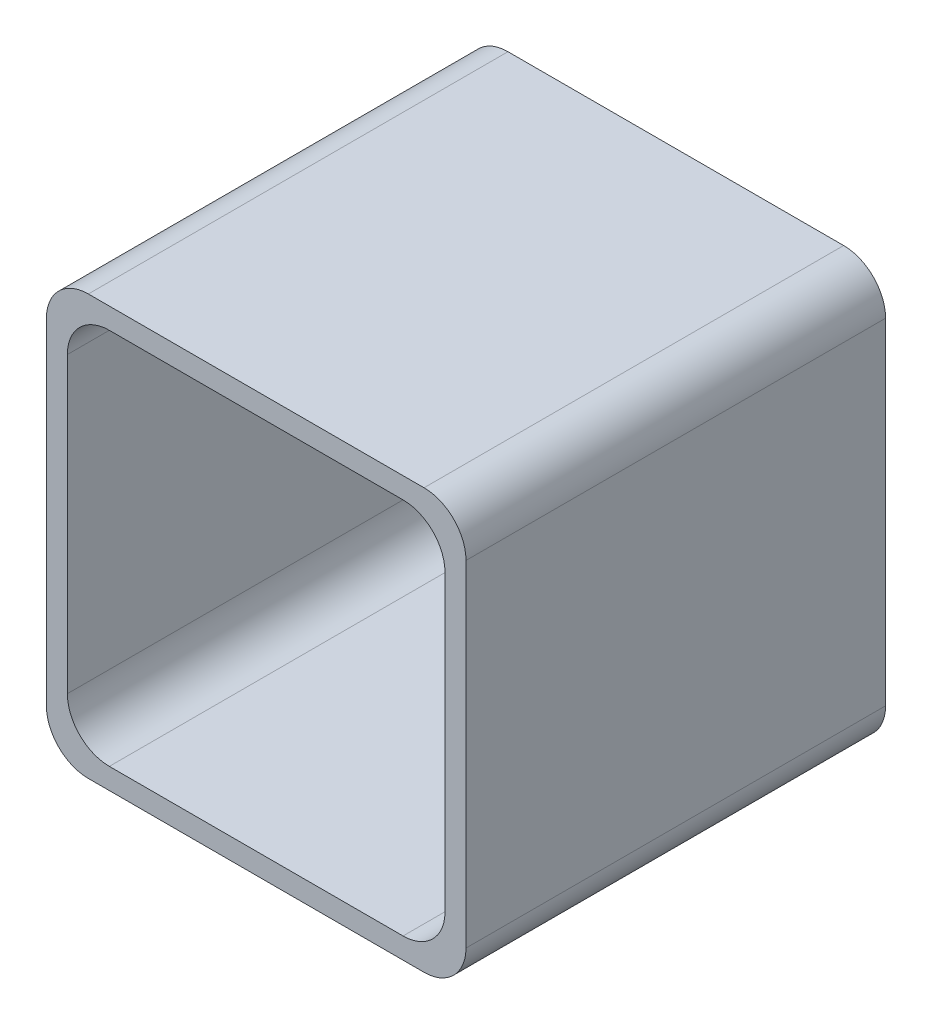
ISO-10303-21;
HEADER;
FILE_DESCRIPTION(('STEP AP214'),'2;1');
FILE_NAME('part.step','',(''),(''),'','','');
FILE_SCHEMA(('AUTOMOTIVE_DESIGN { 1 0 10303 214 1 1 1 1 }'));
ENDSEC;
DATA;
#1=APPLICATION_CONTEXT('core data for automotive mechanical design processes');
#2=APPLICATION_PROTOCOL_DEFINITION('international standard','automotive_design',2000,#1);
#3=PRODUCT_CONTEXT('',#1,'mechanical');
#4=PRODUCT('Part','Part','',(#3));
#5=PRODUCT_RELATED_PRODUCT_CATEGORY('part','',(#4));
#6=PRODUCT_DEFINITION_FORMATION('','',#4);
#7=PRODUCT_DEFINITION_CONTEXT('part definition',#1,'design');
#8=PRODUCT_DEFINITION('design','',#6,#7);
#9=PRODUCT_DEFINITION_SHAPE('','',#8);
#10=(LENGTH_UNIT() NAMED_UNIT(*) SI_UNIT(.MILLI.,.METRE.));
#11=(NAMED_UNIT(*) PLANE_ANGLE_UNIT() SI_UNIT($,.RADIAN.));
#12=(NAMED_UNIT(*) SI_UNIT($,.STERADIAN.) SOLID_ANGLE_UNIT());
#13=UNCERTAINTY_MEASURE_WITH_UNIT(LENGTH_MEASURE(1.E-05),#10,'distance_accuracy_value','');
#14=(GEOMETRIC_REPRESENTATION_CONTEXT(3) GLOBAL_UNCERTAINTY_ASSIGNED_CONTEXT((#13)) GLOBAL_UNIT_ASSIGNED_CONTEXT((#10,
#11,#12)) REPRESENTATION_CONTEXT('',''));
#15=CARTESIAN_POINT('',(0.,0.,0.));
#16=DIRECTION('',(0.,0.,1.));
#17=DIRECTION('',(1.,0.,0.));
#18=AXIS2_PLACEMENT_3D('',#15,#16,#17);
#19=CARTESIAN_POINT('',(25.,-25.,-50.));
#20=DIRECTION('',(1.,0.,0.));
#21=DIRECTION('',(0.,0.,-1.));
#22=AXIS2_PLACEMENT_3D('',#19,#20,#21);
#23=PLANE('',#22);
#24=DIRECTION('',(0.,1.,0.));
#25=VECTOR('',#24,1.);
#26=CARTESIAN_POINT('',(25.,-25.,-50.));
#27=LINE('',#26,#25);
#28=CARTESIAN_POINT('',(25.,-20.,-50.));
#29=VERTEX_POINT('',#28);
#30=CARTESIAN_POINT('',(25.,20.,-50.));
#31=VERTEX_POINT('',#30);
#32=EDGE_CURVE('E225',#29,#31,#27,.T.);
#33=ORIENTED_EDGE('',*,*,#32,.T.);
#34=DIRECTION('',(0.,0.,1.));
#35=VECTOR('',#34,1.);
#36=CARTESIAN_POINT('',(25.,20.,-50.));
#37=LINE('',#36,#35);
#38=CARTESIAN_POINT('',(25.,20.,0.));
#39=VERTEX_POINT('',#38);
#40=EDGE_CURVE('E306',#31,#39,#37,.T.);
#41=ORIENTED_EDGE('',*,*,#40,.T.);
#42=DIRECTION('',(0.,1.,0.));
#43=VECTOR('',#42,1.);
#44=CARTESIAN_POINT('',(25.,-25.,0.));
#45=LINE('',#44,#43);
#46=CARTESIAN_POINT('',(25.,-20.,0.));
#47=VERTEX_POINT('',#46);
#48=EDGE_CURVE('E210',#47,#39,#45,.T.);
#49=ORIENTED_EDGE('',*,*,#48,.F.);
#50=DIRECTION('',(0.,0.,1.));
#51=VECTOR('',#50,1.);
#52=CARTESIAN_POINT('',(25.,-20.,-50.));
#53=LINE('',#52,#51);
#54=EDGE_CURVE('E303',#47,#29,#53,.F.);
#55=ORIENTED_EDGE('',*,*,#54,.T.);
#56=EDGE_LOOP('',(#33,#41,#49,#55));
#57=FACE_BOUND('',#56,.T.);
#58=ADVANCED_FACE('F38',(#57),#23,.T.);
#59=CARTESIAN_POINT('',(-25.,-25.,-50.));
#60=DIRECTION('',(0.,-1.,0.));
#61=DIRECTION('',(0.,0.,-1.));
#62=AXIS2_PLACEMENT_3D('',#59,#60,#61);
#63=PLANE('',#62);
#64=CARTESIAN_POINT('',(0.,-25.,-38.1846380561692));
#65=DIRECTION('',(0.,-1.,0.));
#66=DIRECTION('',(0.,0.,-1.));
#67=AXIS2_PLACEMENT_3D('',#64,#65,#66);
#68=CIRCLE('',#67,6.);
#69=CARTESIAN_POINT('',(0.,-25.,-44.1846380561692));
#70=VERTEX_POINT('',#69);
#71=EDGE_CURVE('E177',#70,#70,#68,.T.);
#72=ORIENTED_EDGE('',*,*,#71,.F.);
#73=EDGE_LOOP('',(#72));
#74=FACE_BOUND('',#73,.T.);
#75=DIRECTION('',(1.,0.,0.));
#76=VECTOR('',#75,1.);
#77=CARTESIAN_POINT('',(-25.,-25.,-50.));
#78=LINE('',#77,#76);
#79=CARTESIAN_POINT('',(-20.,-25.,-50.));
#80=VERTEX_POINT('',#79);
#81=CARTESIAN_POINT('',(20.,-25.,-50.));
#82=VERTEX_POINT('',#81);
#83=EDGE_CURVE('E237',#80,#82,#78,.T.);
#84=ORIENTED_EDGE('',*,*,#83,.T.);
#85=DIRECTION('',(0.,0.,1.));
#86=VECTOR('',#85,1.);
#87=CARTESIAN_POINT('',(20.,-25.,-50.));
#88=LINE('',#87,#86);
#89=CARTESIAN_POINT('',(20.,-25.,0.));
#90=VERTEX_POINT('',#89);
#91=EDGE_CURVE('E343',#82,#90,#88,.T.);
#92=ORIENTED_EDGE('',*,*,#91,.T.);
#93=DIRECTION('',(1.,0.,0.));
#94=VECTOR('',#93,1.);
#95=CARTESIAN_POINT('',(-25.,-25.,0.));
#96=LINE('',#95,#94);
#97=CARTESIAN_POINT('',(-20.,-25.,0.));
#98=VERTEX_POINT('',#97);
#99=EDGE_CURVE('E230',#98,#90,#96,.T.);
#100=ORIENTED_EDGE('',*,*,#99,.F.);
#101=DIRECTION('',(0.,0.,1.));
#102=VECTOR('',#101,1.);
#103=CARTESIAN_POINT('',(-20.,-25.,-50.));
#104=LINE('',#103,#102);
#105=EDGE_CURVE('E340',#98,#80,#104,.F.);
#106=ORIENTED_EDGE('',*,*,#105,.T.);
#107=EDGE_LOOP('',(#84,#92,#100,#106));
#108=FACE_BOUND('',#107,.T.);
#109=ADVANCED_FACE('F412',(#74,#108),#63,.T.);
#110=CARTESIAN_POINT('',(-25.,-25.,-50.));
#111=DIRECTION('',(-1.,0.,0.));
#112=DIRECTION('',(0.,0.,1.));
#113=AXIS2_PLACEMENT_3D('',#110,#111,#112);
#114=PLANE('',#113);
#115=DIRECTION('',(0.,-1.,0.));
#116=VECTOR('',#115,1.);
#117=CARTESIAN_POINT('',(-25.,-25.,-50.));
#118=LINE('',#117,#116);
#119=CARTESIAN_POINT('',(-25.,20.,-50.));
#120=VERTEX_POINT('',#119);
#121=CARTESIAN_POINT('',(-25.,-20.,-50.));
#122=VERTEX_POINT('',#121);
#123=EDGE_CURVE('E234',#120,#122,#118,.T.);
#124=ORIENTED_EDGE('',*,*,#123,.T.);
#125=DIRECTION('',(0.,0.,1.));
#126=VECTOR('',#125,1.);
#127=CARTESIAN_POINT('',(-25.,-20.,-50.));
#128=LINE('',#127,#126);
#129=CARTESIAN_POINT('',(-25.,-20.,0.));
#130=VERTEX_POINT('',#129);
#131=EDGE_CURVE('E349',#122,#130,#128,.T.);
#132=ORIENTED_EDGE('',*,*,#131,.T.);
#133=DIRECTION('',(0.,-1.,0.));
#134=VECTOR('',#133,1.);
#135=CARTESIAN_POINT('',(-25.,-25.,0.));
#136=LINE('',#135,#134);
#137=CARTESIAN_POINT('',(-25.,20.,0.));
#138=VERTEX_POINT('',#137);
#139=EDGE_CURVE('E249',#138,#130,#136,.T.);
#140=ORIENTED_EDGE('',*,*,#139,.F.);
#141=DIRECTION('',(0.,0.,1.));
#142=VECTOR('',#141,1.);
#143=CARTESIAN_POINT('',(-25.,20.,-50.));
#144=LINE('',#143,#142);
#145=EDGE_CURVE('E61',#138,#120,#144,.F.);
#146=ORIENTED_EDGE('',*,*,#145,.T.);
#147=EDGE_LOOP('',(#124,#132,#140,#146));
#148=FACE_BOUND('',#147,.T.);
#149=ADVANCED_FACE('F417',(#148),#114,.T.);
#150=CARTESIAN_POINT('',(-25.,25.,-50.));
#151=DIRECTION('',(0.,1.,0.));
#152=DIRECTION('',(0.,0.,1.));
#153=AXIS2_PLACEMENT_3D('',#150,#151,#152);
#154=PLANE('',#153);
#155=DIRECTION('',(-1.,0.,0.));
#156=VECTOR('',#155,1.);
#157=CARTESIAN_POINT('',(-25.,25.,0.));
#158=LINE('',#157,#156);
#159=CARTESIAN_POINT('',(20.,25.,0.));
#160=VERTEX_POINT('',#159);
#161=CARTESIAN_POINT('',(-20.,25.,0.));
#162=VERTEX_POINT('',#161);
#163=EDGE_CURVE('E245',#160,#162,#158,.T.);
#164=ORIENTED_EDGE('',*,*,#163,.F.);
#165=DIRECTION('',(0.,0.,1.));
#166=VECTOR('',#165,1.);
#167=CARTESIAN_POINT('',(20.,25.,-50.));
#168=LINE('',#167,#166);
#169=CARTESIAN_POINT('',(20.,25.,-50.));
#170=VERTEX_POINT('',#169);
#171=EDGE_CURVE('E326',#160,#170,#168,.F.);
#172=ORIENTED_EDGE('',*,*,#171,.T.);
#173=DIRECTION('',(-1.,0.,0.));
#174=VECTOR('',#173,1.);
#175=CARTESIAN_POINT('',(-25.,25.,-50.));
#176=LINE('',#175,#174);
#177=CARTESIAN_POINT('',(-20.,25.,-50.));
#178=VERTEX_POINT('',#177);
#179=EDGE_CURVE('E229',#170,#178,#176,.T.);
#180=ORIENTED_EDGE('',*,*,#179,.T.);
#181=DIRECTION('',(0.,0.,1.));
#182=VECTOR('',#181,1.);
#183=CARTESIAN_POINT('',(-20.,25.,-50.));
#184=LINE('',#183,#182);
#185=EDGE_CURVE('E322',#178,#162,#184,.T.);
#186=ORIENTED_EDGE('',*,*,#185,.T.);
#187=EDGE_LOOP('',(#164,#172,#180,#186));
#188=FACE_BOUND('',#187,.T.);
#189=ADVANCED_FACE('F421',(#188),#154,.T.);
#190=CARTESIAN_POINT('',(0.,0.,-50.));
#191=DIRECTION('',(0.,0.,-1.));
#192=DIRECTION('',(-1.,0.,0.));
#193=AXIS2_PLACEMENT_3D('',#190,#191,#192);
#194=PLANE('',#193);
#195=ORIENTED_EDGE('',*,*,#179,.F.);
#196=CARTESIAN_POINT('',(20.,20.,-50.));
#197=DIRECTION('',(0.,0.,-1.));
#198=DIRECTION('',(-1.,0.,0.));
#199=AXIS2_PLACEMENT_3D('',#196,#197,#198);
#200=CIRCLE('',#199,5.);
#201=EDGE_CURVE('E337',#170,#31,#200,.T.);
#202=ORIENTED_EDGE('',*,*,#201,.T.);
#203=ORIENTED_EDGE('',*,*,#32,.F.);
#204=CARTESIAN_POINT('',(20.,-20.,-50.));
#205=DIRECTION('',(0.,0.,-1.));
#206=DIRECTION('',(-1.,0.,0.));
#207=AXIS2_PLACEMENT_3D('',#204,#205,#206);
#208=CIRCLE('',#207,5.);
#209=EDGE_CURVE('E334',#29,#82,#208,.T.);
#210=ORIENTED_EDGE('',*,*,#209,.T.);
#211=ORIENTED_EDGE('',*,*,#83,.F.);
#212=CARTESIAN_POINT('',(-20.,-20.,-50.));
#213=DIRECTION('',(0.,0.,-1.));
#214=DIRECTION('',(-1.,0.,0.));
#215=AXIS2_PLACEMENT_3D('',#212,#213,#214);
#216=CIRCLE('',#215,5.);
#217=EDGE_CURVE('E54',#80,#122,#216,.T.);
#218=ORIENTED_EDGE('',*,*,#217,.T.);
#219=ORIENTED_EDGE('',*,*,#123,.F.);
#220=CARTESIAN_POINT('',(-20.,20.,-50.));
#221=DIRECTION('',(0.,0.,-1.));
#222=DIRECTION('',(-1.,0.,0.));
#223=AXIS2_PLACEMENT_3D('',#220,#221,#222);
#224=CIRCLE('',#223,5.);
#225=EDGE_CURVE('E329',#120,#178,#224,.T.);
#226=ORIENTED_EDGE('',*,*,#225,.T.);
#227=EDGE_LOOP('',(#195,#202,#203,#210,#211,#218,#219,#226));
#228=FACE_BOUND('',#227,.T.);
#229=ADVANCED_FACE('F424',(#228),#194,.T.);
#230=CARTESIAN_POINT('',(0.,0.,0.));
#231=DIRECTION('',(0.,0.,-1.));
#232=DIRECTION('',(-1.,0.,0.));
#233=AXIS2_PLACEMENT_3D('',#230,#231,#232);
#234=PLANE('',#233);
#235=DIRECTION('',(-1.,0.,0.));
#236=VECTOR('',#235,1.);
#237=CARTESIAN_POINT('',(-22.5,22.5,0.));
#238=LINE('',#237,#236);
#239=CARTESIAN_POINT('',(17.5,22.5,0.));
#240=VERTEX_POINT('',#239);
#241=CARTESIAN_POINT('',(-17.5,22.5,0.));
#242=VERTEX_POINT('',#241);
#243=EDGE_CURVE('E214',#240,#242,#238,.T.);
#244=ORIENTED_EDGE('',*,*,#243,.F.);
#245=CARTESIAN_POINT('',(17.5,17.5,0.));
#246=DIRECTION('',(0.,0.,-1.));
#247=DIRECTION('',(-1.,0.,0.));
#248=AXIS2_PLACEMENT_3D('',#245,#246,#247);
#249=CIRCLE('',#248,5.);
#250=CARTESIAN_POINT('',(22.5,17.5,0.));
#251=VERTEX_POINT('',#250);
#252=EDGE_CURVE('E353',#240,#251,#249,.T.);
#253=ORIENTED_EDGE('',*,*,#252,.T.);
#254=DIRECTION('',(0.,1.,0.));
#255=VECTOR('',#254,1.);
#256=CARTESIAN_POINT('',(22.5,-22.5,0.));
#257=LINE('',#256,#255);
#258=CARTESIAN_POINT('',(22.5,-17.5,0.));
#259=VERTEX_POINT('',#258);
#260=EDGE_CURVE('E192',#259,#251,#257,.T.);
#261=ORIENTED_EDGE('',*,*,#260,.F.);
#262=CARTESIAN_POINT('',(17.5,-17.5,0.));
#263=DIRECTION('',(0.,0.,-1.));
#264=DIRECTION('',(-1.,0.,0.));
#265=AXIS2_PLACEMENT_3D('',#262,#263,#264);
#266=CIRCLE('',#265,5.);
#267=CARTESIAN_POINT('',(17.5,-22.5,0.));
#268=VERTEX_POINT('',#267);
#269=EDGE_CURVE('E356',#259,#268,#266,.T.);
#270=ORIENTED_EDGE('',*,*,#269,.T.);
#271=DIRECTION('',(1.,0.,0.));
#272=VECTOR('',#271,1.);
#273=CARTESIAN_POINT('',(-22.5,-22.5,0.));
#274=LINE('',#273,#272);
#275=CARTESIAN_POINT('',(-17.5,-22.5,0.));
#276=VERTEX_POINT('',#275);
#277=EDGE_CURVE('E198',#276,#268,#274,.T.);
#278=ORIENTED_EDGE('',*,*,#277,.F.);
#279=CARTESIAN_POINT('',(-17.5,-17.5,0.));
#280=DIRECTION('',(0.,0.,-1.));
#281=DIRECTION('',(-1.,0.,0.));
#282=AXIS2_PLACEMENT_3D('',#279,#280,#281);
#283=CIRCLE('',#282,5.);
#284=CARTESIAN_POINT('',(-22.5,-17.5,0.));
#285=VERTEX_POINT('',#284);
#286=EDGE_CURVE('E11',#276,#285,#283,.T.);
#287=ORIENTED_EDGE('',*,*,#286,.T.);
#288=DIRECTION('',(0.,-1.,0.));
#289=VECTOR('',#288,1.);
#290=CARTESIAN_POINT('',(-22.5,-22.5,0.));
#291=LINE('',#290,#289);
#292=CARTESIAN_POINT('',(-22.5,17.5,0.));
#293=VERTEX_POINT('',#292);
#294=EDGE_CURVE('E218',#293,#285,#291,.T.);
#295=ORIENTED_EDGE('',*,*,#294,.F.);
#296=CARTESIAN_POINT('',(-17.5,17.5,0.));
#297=DIRECTION('',(0.,0.,-1.));
#298=DIRECTION('',(-1.,0.,0.));
#299=AXIS2_PLACEMENT_3D('',#296,#297,#298);
#300=CIRCLE('',#299,5.);
#301=EDGE_CURVE('E47',#293,#242,#300,.T.);
#302=ORIENTED_EDGE('',*,*,#301,.T.);
#303=EDGE_LOOP('',(#244,#253,#261,#270,#278,#287,#295,#302));
#304=FACE_BOUND('',#303,.T.);
#305=ORIENTED_EDGE('',*,*,#48,.T.);
#306=CARTESIAN_POINT('',(20.,20.,0.));
#307=DIRECTION('',(0.,0.,-1.));
#308=DIRECTION('',(-1.,0.,0.));
#309=AXIS2_PLACEMENT_3D('',#306,#307,#308);
#310=CIRCLE('',#309,5.);
#311=EDGE_CURVE('E319',#39,#160,#310,.F.);
#312=ORIENTED_EDGE('',*,*,#311,.T.);
#313=ORIENTED_EDGE('',*,*,#163,.T.);
#314=CARTESIAN_POINT('',(-20.,20.,0.));
#315=DIRECTION('',(0.,0.,-1.));
#316=DIRECTION('',(-1.,0.,0.));
#317=AXIS2_PLACEMENT_3D('',#314,#315,#316);
#318=CIRCLE('',#317,5.);
#319=EDGE_CURVE('E310',#162,#138,#318,.F.);
#320=ORIENTED_EDGE('',*,*,#319,.T.);
#321=ORIENTED_EDGE('',*,*,#139,.T.);
#322=CARTESIAN_POINT('',(-20.,-20.,0.));
#323=DIRECTION('',(0.,0.,-1.));
#324=DIRECTION('',(-1.,0.,0.));
#325=AXIS2_PLACEMENT_3D('',#322,#323,#324);
#326=CIRCLE('',#325,5.);
#327=EDGE_CURVE('E313',#130,#98,#326,.F.);
#328=ORIENTED_EDGE('',*,*,#327,.T.);
#329=ORIENTED_EDGE('',*,*,#99,.T.);
#330=CARTESIAN_POINT('',(20.,-20.,0.));
#331=DIRECTION('',(0.,0.,-1.));
#332=DIRECTION('',(-1.,0.,0.));
#333=AXIS2_PLACEMENT_3D('',#330,#331,#332);
#334=CIRCLE('',#333,5.);
#335=EDGE_CURVE('E316',#90,#47,#334,.F.);
#336=ORIENTED_EDGE('',*,*,#335,.T.);
#337=EDGE_LOOP('',(#305,#312,#313,#320,#321,#328,#329,#336));
#338=FACE_BOUND('',#337,.T.);
#339=ADVANCED_FACE('F362',(#304,#338),#234,.F.);
#340=CARTESIAN_POINT('',(22.5,-22.5,-45.));
#341=DIRECTION('',(1.,0.,0.));
#342=DIRECTION('',(0.,0.,-1.));
#343=AXIS2_PLACEMENT_3D('',#340,#341,#342);
#344=PLANE('',#343);
#345=ORIENTED_EDGE('',*,*,#260,.T.);
#346=DIRECTION('',(0.,0.,1.));
#347=VECTOR('',#346,1.);
#348=CARTESIAN_POINT('',(22.5,17.5,-45.));
#349=LINE('',#348,#347);
#350=CARTESIAN_POINT('',(22.5,17.5,-45.));
#351=VERTEX_POINT('',#350);
#352=EDGE_CURVE('E274',#251,#351,#349,.F.);
#353=ORIENTED_EDGE('',*,*,#352,.T.);
#354=DIRECTION('',(0.,1.,0.));
#355=VECTOR('',#354,1.);
#356=CARTESIAN_POINT('',(22.5,-22.5,-45.));
#357=LINE('',#356,#355);
#358=CARTESIAN_POINT('',(22.5,-17.5,-45.));
#359=VERTEX_POINT('',#358);
#360=EDGE_CURVE('E193',#359,#351,#357,.T.);
#361=ORIENTED_EDGE('',*,*,#360,.F.);
#362=DIRECTION('',(0.,0.,1.));
#363=VECTOR('',#362,1.);
#364=CARTESIAN_POINT('',(22.5,-17.5,0.));
#365=LINE('',#364,#363);
#366=EDGE_CURVE('E270',#359,#259,#365,.T.);
#367=ORIENTED_EDGE('',*,*,#366,.T.);
#368=EDGE_LOOP('',(#345,#353,#361,#367));
#369=FACE_BOUND('',#368,.T.);
#370=ADVANCED_FACE('F395',(#369),#344,.F.);
#371=CARTESIAN_POINT('',(-22.5,-22.5,-45.));
#372=DIRECTION('',(0.,-1.,0.));
#373=DIRECTION('',(0.,0.,-1.));
#374=AXIS2_PLACEMENT_3D('',#371,#372,#373);
#375=PLANE('',#374);
#376=CARTESIAN_POINT('',(0.,-22.5,-38.1846380561692));
#377=DIRECTION('',(0.,1.,0.));
#378=DIRECTION('',(0.,0.,1.));
#379=AXIS2_PLACEMENT_3D('',#376,#377,#378);
#380=CIRCLE('',#379,6.);
#381=CARTESIAN_POINT('',(0.,-22.5,-32.1846380561692));
#382=VERTEX_POINT('',#381);
#383=EDGE_CURVE('E682',#382,#382,#380,.T.);
#384=ORIENTED_EDGE('',*,*,#383,.F.);
#385=EDGE_LOOP('',(#384));
#386=FACE_BOUND('',#385,.T.);
#387=ORIENTED_EDGE('',*,*,#277,.T.);
#388=DIRECTION('',(0.,0.,1.));
#389=VECTOR('',#388,1.);
#390=CARTESIAN_POINT('',(17.5,-22.5,-45.));
#391=LINE('',#390,#389);
#392=CARTESIAN_POINT('',(17.5,-22.5,-45.));
#393=VERTEX_POINT('',#392);
#394=EDGE_CURVE('E293',#268,#393,#391,.F.);
#395=ORIENTED_EDGE('',*,*,#394,.T.);
#396=DIRECTION('',(1.,0.,0.));
#397=VECTOR('',#396,1.);
#398=CARTESIAN_POINT('',(-22.5,-22.5,-45.));
#399=LINE('',#398,#397);
#400=CARTESIAN_POINT('',(-17.5,-22.5,-45.));
#401=VERTEX_POINT('',#400);
#402=EDGE_CURVE('E206',#401,#393,#399,.T.);
#403=ORIENTED_EDGE('',*,*,#402,.F.);
#404=DIRECTION('',(0.,0.,1.));
#405=VECTOR('',#404,1.);
#406=CARTESIAN_POINT('',(-17.5,-22.5,0.));
#407=LINE('',#406,#405);
#408=EDGE_CURVE('E289',#401,#276,#407,.T.);
#409=ORIENTED_EDGE('',*,*,#408,.T.);
#410=EDGE_LOOP('',(#387,#395,#403,#409));
#411=FACE_BOUND('',#410,.T.);
#412=ADVANCED_FACE('F386',(#386,#411),#375,.F.);
#413=CARTESIAN_POINT('',(-22.5,-22.5,-45.));
#414=DIRECTION('',(-1.,0.,0.));
#415=DIRECTION('',(0.,0.,1.));
#416=AXIS2_PLACEMENT_3D('',#413,#414,#415);
#417=PLANE('',#416);
#418=DIRECTION('',(0.,-1.,0.));
#419=VECTOR('',#418,1.);
#420=CARTESIAN_POINT('',(-22.5,-22.5,-45.));
#421=LINE('',#420,#419);
#422=CARTESIAN_POINT('',(-22.5,17.5,-45.));
#423=VERTEX_POINT('',#422);
#424=CARTESIAN_POINT('',(-22.5,-17.5,-45.));
#425=VERTEX_POINT('',#424);
#426=EDGE_CURVE('E202',#423,#425,#421,.T.);
#427=ORIENTED_EDGE('',*,*,#426,.F.);
#428=DIRECTION('',(0.,0.,1.));
#429=VECTOR('',#428,1.);
#430=CARTESIAN_POINT('',(-22.5,17.5,0.));
#431=LINE('',#430,#429);
#432=EDGE_CURVE('E299',#423,#293,#431,.T.);
#433=ORIENTED_EDGE('',*,*,#432,.T.);
#434=ORIENTED_EDGE('',*,*,#294,.T.);
#435=DIRECTION('',(0.,0.,1.));
#436=VECTOR('',#435,1.);
#437=CARTESIAN_POINT('',(-22.5,-17.5,-45.));
#438=LINE('',#437,#436);
#439=EDGE_CURVE('E296',#285,#425,#438,.F.);
#440=ORIENTED_EDGE('',*,*,#439,.T.);
#441=EDGE_LOOP('',(#427,#433,#434,#440));
#442=FACE_BOUND('',#441,.T.);
#443=ADVANCED_FACE('F378',(#442),#417,.F.);
#444=CARTESIAN_POINT('',(-22.5,22.5,-45.));
#445=DIRECTION('',(0.,1.,0.));
#446=DIRECTION('',(0.,0.,1.));
#447=AXIS2_PLACEMENT_3D('',#444,#445,#446);
#448=PLANE('',#447);
#449=DIRECTION('',(-1.,0.,0.));
#450=VECTOR('',#449,1.);
#451=CARTESIAN_POINT('',(-22.5,22.5,-45.));
#452=LINE('',#451,#450);
#453=CARTESIAN_POINT('',(17.5,22.5,-45.));
#454=VERTEX_POINT('',#453);
#455=CARTESIAN_POINT('',(-17.5,22.5,-45.));
#456=VERTEX_POINT('',#455);
#457=EDGE_CURVE('E197',#454,#456,#452,.T.);
#458=ORIENTED_EDGE('',*,*,#457,.F.);
#459=DIRECTION('',(0.,0.,1.));
#460=VECTOR('',#459,1.);
#461=CARTESIAN_POINT('',(17.5,22.5,0.));
#462=LINE('',#461,#460);
#463=EDGE_CURVE('E266',#454,#240,#462,.T.);
#464=ORIENTED_EDGE('',*,*,#463,.T.);
#465=ORIENTED_EDGE('',*,*,#243,.T.);
#466=DIRECTION('',(0.,0.,1.));
#467=VECTOR('',#466,1.);
#468=CARTESIAN_POINT('',(-17.5,22.5,-45.));
#469=LINE('',#468,#467);
#470=EDGE_CURVE('E263',#242,#456,#469,.F.);
#471=ORIENTED_EDGE('',*,*,#470,.T.);
#472=EDGE_LOOP('',(#458,#464,#465,#471));
#473=FACE_BOUND('',#472,.T.);
#474=ADVANCED_FACE('F369',(#473),#448,.F.);
#475=CARTESIAN_POINT('',(0.,0.,-45.));
#476=DIRECTION('',(0.,0.,-1.));
#477=DIRECTION('',(-1.,0.,0.));
#478=AXIS2_PLACEMENT_3D('',#475,#476,#477);
#479=PLANE('',#478);
#480=CARTESIAN_POINT('',(14.5,0.,-45.));
#481=DIRECTION('',(0.,0.,-1.));
#482=DIRECTION('',(-1.,0.,0.));
#483=AXIS2_PLACEMENT_3D('',#480,#481,#482);
#484=CIRCLE('',#483,3.);
#485=CARTESIAN_POINT('',(11.5,0.,-45.));
#486=VERTEX_POINT('',#485);
#487=EDGE_CURVE('E259',#486,#486,#484,.F.);
#488=ORIENTED_EDGE('',*,*,#487,.F.);
#489=EDGE_LOOP('',(#488));
#490=FACE_BOUND('',#489,.T.);
#491=CARTESIAN_POINT('',(-14.5,0.,-45.));
#492=DIRECTION('',(0.,0.,-1.));
#493=DIRECTION('',(-1.,0.,0.));
#494=AXIS2_PLACEMENT_3D('',#491,#492,#493);
#495=CIRCLE('',#494,3.);
#496=CARTESIAN_POINT('',(-17.5,0.,-45.));
#497=VERTEX_POINT('',#496);
#498=EDGE_CURVE('E241',#497,#497,#495,.F.);
#499=ORIENTED_EDGE('',*,*,#498,.F.);
#500=EDGE_LOOP('',(#499));
#501=FACE_BOUND('',#500,.T.);
#502=ORIENTED_EDGE('',*,*,#360,.T.);
#503=CARTESIAN_POINT('',(17.5,17.5,-45.));
#504=DIRECTION('',(0.,0.,-1.));
#505=DIRECTION('',(-1.,0.,0.));
#506=AXIS2_PLACEMENT_3D('',#503,#504,#505);
#507=CIRCLE('',#506,5.);
#508=EDGE_CURVE('E286',#351,#454,#507,.F.);
#509=ORIENTED_EDGE('',*,*,#508,.T.);
#510=ORIENTED_EDGE('',*,*,#457,.T.);
#511=CARTESIAN_POINT('',(-17.5,17.5,-45.));
#512=DIRECTION('',(0.,0.,-1.));
#513=DIRECTION('',(-1.,0.,0.));
#514=AXIS2_PLACEMENT_3D('',#511,#512,#513);
#515=CIRCLE('',#514,5.);
#516=EDGE_CURVE('E280',#456,#423,#515,.F.);
#517=ORIENTED_EDGE('',*,*,#516,.T.);
#518=ORIENTED_EDGE('',*,*,#426,.T.);
#519=CARTESIAN_POINT('',(-17.5,-17.5,-45.));
#520=DIRECTION('',(0.,0.,-1.));
#521=DIRECTION('',(-1.,0.,0.));
#522=AXIS2_PLACEMENT_3D('',#519,#520,#521);
#523=CIRCLE('',#522,5.);
#524=EDGE_CURVE('E277',#425,#401,#523,.F.);
#525=ORIENTED_EDGE('',*,*,#524,.T.);
#526=ORIENTED_EDGE('',*,*,#402,.T.);
#527=CARTESIAN_POINT('',(17.5,-17.5,-45.));
#528=DIRECTION('',(0.,0.,-1.));
#529=DIRECTION('',(-1.,0.,0.));
#530=AXIS2_PLACEMENT_3D('',#527,#528,#529);
#531=CIRCLE('',#530,5.);
#532=EDGE_CURVE('E283',#393,#359,#531,.F.);
#533=ORIENTED_EDGE('',*,*,#532,.T.);
#534=EDGE_LOOP('',(#502,#509,#510,#517,#518,#525,#526,#533));
#535=FACE_BOUND('',#534,.T.);
#536=ADVANCED_FACE('F375',(#490,#501,#535),#479,.F.);
#537=CARTESIAN_POINT('',(-14.5,0.,-37.));
#538=DIRECTION('',(0.,0.,-1.));
#539=DIRECTION('',(-1.,0.,0.));
#540=AXIS2_PLACEMENT_3D('',#537,#538,#539);
#541=CYLINDRICAL_SURFACE('',#540,3.);
#542=CARTESIAN_POINT('',(-14.5,0.,-37.));
#543=DIRECTION('',(0.,0.,1.));
#544=DIRECTION('',(1.,0.,0.));
#545=AXIS2_PLACEMENT_3D('',#542,#543,#544);
#546=CIRCLE('',#545,3.);
#547=CARTESIAN_POINT('',(-11.5,0.,-37.));
#548=VERTEX_POINT('',#547);
#549=EDGE_CURVE('E188',#548,#548,#546,.T.);
#550=ORIENTED_EDGE('',*,*,#549,.F.);
#551=EDGE_LOOP('',(#550));
#552=FACE_BOUND('',#551,.T.);
#553=ORIENTED_EDGE('',*,*,#498,.T.);
#554=EDGE_LOOP('',(#553));
#555=FACE_BOUND('',#554,.T.);
#556=ADVANCED_FACE('F443',(#552,#555),#541,.T.);
#557=CARTESIAN_POINT('',(-14.5,0.,-37.));
#558=DIRECTION('',(0.,0.,1.));
#559=DIRECTION('',(1.,0.,0.));
#560=AXIS2_PLACEMENT_3D('',#557,#558,#559);
#561=PLANE('',#560);
#562=CARTESIAN_POINT('',(-14.5,0.,-37.));
#563=DIRECTION('',(0.,0.,1.));
#564=DIRECTION('',(1.,0.,0.));
#565=AXIS2_PLACEMENT_3D('',#562,#563,#564);
#566=CIRCLE('',#565,1.24999999999999);
#567=CARTESIAN_POINT('',(-13.25,0.,-37.));
#568=VERTEX_POINT('',#567);
#569=EDGE_CURVE('E169',#568,#568,#566,.T.);
#570=ORIENTED_EDGE('',*,*,#569,.F.);
#571=EDGE_LOOP('',(#570));
#572=FACE_BOUND('',#571,.T.);
#573=ORIENTED_EDGE('',*,*,#549,.T.);
#574=EDGE_LOOP('',(#573));
#575=FACE_BOUND('',#574,.T.);
#576=ADVANCED_FACE('F447',(#572,#575),#561,.T.);
#577=CARTESIAN_POINT('',(14.5,0.,-37.));
#578=DIRECTION('',(0.,0.,-1.));
#579=DIRECTION('',(-1.,0.,0.));
#580=AXIS2_PLACEMENT_3D('',#577,#578,#579);
#581=CYLINDRICAL_SURFACE('',#580,3.);
#582=CARTESIAN_POINT('',(14.5,0.,-37.));
#583=DIRECTION('',(0.,0.,1.));
#584=DIRECTION('',(1.,0.,0.));
#585=AXIS2_PLACEMENT_3D('',#582,#583,#584);
#586=CIRCLE('',#585,3.);
#587=CARTESIAN_POINT('',(17.5,0.,-37.));
#588=VERTEX_POINT('',#587);
#589=EDGE_CURVE('E184',#588,#588,#586,.T.);
#590=ORIENTED_EDGE('',*,*,#589,.F.);
#591=EDGE_LOOP('',(#590));
#592=FACE_BOUND('',#591,.T.);
#593=ORIENTED_EDGE('',*,*,#487,.T.);
#594=EDGE_LOOP('',(#593));
#595=FACE_BOUND('',#594,.T.);
#596=ADVANCED_FACE('F451',(#592,#595),#581,.T.);
#597=CARTESIAN_POINT('',(14.5,0.,-37.));
#598=DIRECTION('',(0.,0.,1.));
#599=DIRECTION('',(1.,0.,0.));
#600=AXIS2_PLACEMENT_3D('',#597,#598,#599);
#601=PLANE('',#600);
#602=CARTESIAN_POINT('',(14.5,0.,-37.));
#603=DIRECTION('',(0.,0.,1.));
#604=DIRECTION('',(1.,0.,0.));
#605=AXIS2_PLACEMENT_3D('',#602,#603,#604);
#606=CIRCLE('',#605,1.24999999999999);
#607=CARTESIAN_POINT('',(15.75,0.,-37.));
#608=VERTEX_POINT('',#607);
#609=EDGE_CURVE('E168',#608,#608,#606,.T.);
#610=ORIENTED_EDGE('',*,*,#609,.F.);
#611=EDGE_LOOP('',(#610));
#612=FACE_BOUND('',#611,.T.);
#613=ORIENTED_EDGE('',*,*,#589,.T.);
#614=EDGE_LOOP('',(#613));
#615=FACE_BOUND('',#614,.T.);
#616=ADVANCED_FACE('F455',(#612,#615),#601,.T.);
#617=CARTESIAN_POINT('',(14.5,0.,-45.));
#618=DIRECTION('',(0.,0.,1.));
#619=DIRECTION('',(1.,0.,0.));
#620=AXIS2_PLACEMENT_3D('',#617,#618,#619);
#621=CONICAL_SURFACE('',#620,1.24999999999999,1.02974425867664);
#622=CARTESIAN_POINT('',(14.5,0.,-45.7510757737845));
#623=VERTEX_POINT('',#622);
#624=VERTEX_LOOP('',#623);
#625=FACE_BOUND('',#624,.T.);
#626=CARTESIAN_POINT('',(14.5,0.,-45.));
#627=DIRECTION('',(0.,0.,1.));
#628=DIRECTION('',(1.,0.,0.));
#629=AXIS2_PLACEMENT_3D('',#626,#627,#628);
#630=CIRCLE('',#629,1.24999999999999);
#631=CARTESIAN_POINT('',(15.75,0.,-45.));
#632=VERTEX_POINT('',#631);
#633=EDGE_CURVE('E174',#632,#632,#630,.T.);
#634=ORIENTED_EDGE('',*,*,#633,.T.);
#635=EDGE_LOOP('',(#634));
#636=FACE_BOUND('',#635,.T.);
#637=ADVANCED_FACE('F459',(#625,#636),#621,.F.);
#638=CARTESIAN_POINT('',(14.5,0.,-37.));
#639=DIRECTION('',(0.,0.,1.));
#640=DIRECTION('',(1.,0.,0.));
#641=AXIS2_PLACEMENT_3D('',#638,#639,#640);
#642=CYLINDRICAL_SURFACE('',#641,1.24999999999999);
#643=ORIENTED_EDGE('',*,*,#633,.F.);
#644=EDGE_LOOP('',(#643));
#645=FACE_BOUND('',#644,.T.);
#646=ORIENTED_EDGE('',*,*,#609,.T.);
#647=EDGE_LOOP('',(#646));
#648=FACE_BOUND('',#647,.T.);
#649=ADVANCED_FACE('F161',(#645,#648),#642,.F.);
#650=CARTESIAN_POINT('',(-14.5,0.,-45.));
#651=DIRECTION('',(0.,0.,1.));
#652=DIRECTION('',(1.,0.,0.));
#653=AXIS2_PLACEMENT_3D('',#650,#651,#652);
#654=CONICAL_SURFACE('',#653,1.24999999999999,1.02974425867665);
#655=CARTESIAN_POINT('',(-14.5,0.,-45.7510757737845));
#656=VERTEX_POINT('',#655);
#657=VERTEX_LOOP('',#656);
#658=FACE_BOUND('',#657,.T.);
#659=CARTESIAN_POINT('',(-14.5,0.,-45.));
#660=DIRECTION('',(0.,0.,1.));
#661=DIRECTION('',(1.,0.,0.));
#662=AXIS2_PLACEMENT_3D('',#659,#660,#661);
#663=CIRCLE('',#662,1.24999999999999);
#664=CARTESIAN_POINT('',(-13.25,0.,-45.));
#665=VERTEX_POINT('',#664);
#666=EDGE_CURVE('E165',#665,#665,#663,.T.);
#667=ORIENTED_EDGE('',*,*,#666,.T.);
#668=EDGE_LOOP('',(#667));
#669=FACE_BOUND('',#668,.T.);
#670=ADVANCED_FACE('F157',(#658,#669),#654,.F.);
#671=CARTESIAN_POINT('',(-14.5,0.,-37.));
#672=DIRECTION('',(0.,0.,1.));
#673=DIRECTION('',(1.,0.,0.));
#674=AXIS2_PLACEMENT_3D('',#671,#672,#673);
#675=CYLINDRICAL_SURFACE('',#674,1.24999999999999);
#676=ORIENTED_EDGE('',*,*,#666,.F.);
#677=EDGE_LOOP('',(#676));
#678=FACE_BOUND('',#677,.T.);
#679=ORIENTED_EDGE('',*,*,#569,.T.);
#680=EDGE_LOOP('',(#679));
#681=FACE_BOUND('',#680,.T.);
#682=ADVANCED_FACE('F160',(#678,#681),#675,.F.);
#683=CARTESIAN_POINT('',(0.,-27.5,-38.1846380561692));
#684=DIRECTION('',(0.,1.,0.));
#685=DIRECTION('',(0.,0.,1.));
#686=AXIS2_PLACEMENT_3D('',#683,#684,#685);
#687=CYLINDRICAL_SURFACE('',#686,6.);
#688=ORIENTED_EDGE('',*,*,#71,.T.);
#689=EDGE_LOOP('',(#688));
#690=FACE_BOUND('',#689,.T.);
#691=ORIENTED_EDGE('',*,*,#383,.T.);
#692=EDGE_LOOP('',(#691));
#693=FACE_BOUND('',#692,.T.);
#694=ADVANCED_FACE('F401',(#690,#693),#687,.F.);
#695=CARTESIAN_POINT('',(17.5,17.5,-45.));
#696=DIRECTION('',(0.,0.,-1.));
#697=DIRECTION('',(-1.,0.,0.));
#698=AXIS2_PLACEMENT_3D('',#695,#696,#697);
#699=CYLINDRICAL_SURFACE('',#698,5.);
#700=ORIENTED_EDGE('',*,*,#508,.F.);
#701=ORIENTED_EDGE('',*,*,#352,.F.);
#702=ORIENTED_EDGE('',*,*,#252,.F.);
#703=ORIENTED_EDGE('',*,*,#463,.F.);
#704=EDGE_LOOP('',(#700,#701,#702,#703));
#705=FACE_BOUND('',#704,.T.);
#706=ADVANCED_FACE('F399',(#705),#699,.F.);
#707=CARTESIAN_POINT('',(17.5,-17.5,-45.));
#708=DIRECTION('',(0.,0.,-1.));
#709=DIRECTION('',(-1.,0.,0.));
#710=AXIS2_PLACEMENT_3D('',#707,#708,#709);
#711=CYLINDRICAL_SURFACE('',#710,5.);
#712=ORIENTED_EDGE('',*,*,#532,.F.);
#713=ORIENTED_EDGE('',*,*,#394,.F.);
#714=ORIENTED_EDGE('',*,*,#269,.F.);
#715=ORIENTED_EDGE('',*,*,#366,.F.);
#716=EDGE_LOOP('',(#712,#713,#714,#715));
#717=FACE_BOUND('',#716,.T.);
#718=ADVANCED_FACE('F390',(#717),#711,.F.);
#719=CARTESIAN_POINT('',(-17.5,17.5,-45.));
#720=DIRECTION('',(0.,0.,-1.));
#721=DIRECTION('',(-1.,0.,0.));
#722=AXIS2_PLACEMENT_3D('',#719,#720,#721);
#723=CYLINDRICAL_SURFACE('',#722,5.);
#724=ORIENTED_EDGE('',*,*,#516,.F.);
#725=ORIENTED_EDGE('',*,*,#470,.F.);
#726=ORIENTED_EDGE('',*,*,#301,.F.);
#727=ORIENTED_EDGE('',*,*,#432,.F.);
#728=EDGE_LOOP('',(#724,#725,#726,#727));
#729=FACE_BOUND('',#728,.T.);
#730=ADVANCED_FACE('F372',(#729),#723,.F.);
#731=CARTESIAN_POINT('',(-17.5,-17.5,-45.));
#732=DIRECTION('',(0.,0.,-1.));
#733=DIRECTION('',(-1.,0.,0.));
#734=AXIS2_PLACEMENT_3D('',#731,#732,#733);
#735=CYLINDRICAL_SURFACE('',#734,5.);
#736=ORIENTED_EDGE('',*,*,#524,.F.);
#737=ORIENTED_EDGE('',*,*,#439,.F.);
#738=ORIENTED_EDGE('',*,*,#286,.F.);
#739=ORIENTED_EDGE('',*,*,#408,.F.);
#740=EDGE_LOOP('',(#736,#737,#738,#739));
#741=FACE_BOUND('',#740,.T.);
#742=ADVANCED_FACE('F381',(#741),#735,.F.);
#743=CARTESIAN_POINT('',(20.,20.,-50.));
#744=DIRECTION('',(0.,0.,1.));
#745=DIRECTION('',(1.,0.,0.));
#746=AXIS2_PLACEMENT_3D('',#743,#744,#745);
#747=CYLINDRICAL_SURFACE('',#746,5.);
#748=ORIENTED_EDGE('',*,*,#201,.F.);
#749=ORIENTED_EDGE('',*,*,#171,.F.);
#750=ORIENTED_EDGE('',*,*,#311,.F.);
#751=ORIENTED_EDGE('',*,*,#40,.F.);
#752=EDGE_LOOP('',(#748,#749,#750,#751));
#753=FACE_BOUND('',#752,.T.);
#754=ADVANCED_FACE('F575',(#753),#747,.T.);
#755=CARTESIAN_POINT('',(20.,-20.,-50.));
#756=DIRECTION('',(0.,0.,1.));
#757=DIRECTION('',(1.,0.,0.));
#758=AXIS2_PLACEMENT_3D('',#755,#756,#757);
#759=CYLINDRICAL_SURFACE('',#758,5.);
#760=ORIENTED_EDGE('',*,*,#209,.F.);
#761=ORIENTED_EDGE('',*,*,#54,.F.);
#762=ORIENTED_EDGE('',*,*,#335,.F.);
#763=ORIENTED_EDGE('',*,*,#91,.F.);
#764=EDGE_LOOP('',(#760,#761,#762,#763));
#765=FACE_BOUND('',#764,.T.);
#766=ADVANCED_FACE('F584',(#765),#759,.T.);
#767=CARTESIAN_POINT('',(-20.,-20.,-50.));
#768=DIRECTION('',(0.,0.,1.));
#769=DIRECTION('',(1.,0.,0.));
#770=AXIS2_PLACEMENT_3D('',#767,#768,#769);
#771=CYLINDRICAL_SURFACE('',#770,5.);
#772=ORIENTED_EDGE('',*,*,#217,.F.);
#773=ORIENTED_EDGE('',*,*,#105,.F.);
#774=ORIENTED_EDGE('',*,*,#327,.F.);
#775=ORIENTED_EDGE('',*,*,#131,.F.);
#776=EDGE_LOOP('',(#772,#773,#774,#775));
#777=FACE_BOUND('',#776,.T.);
#778=ADVANCED_FACE('F594',(#777),#771,.T.);
#779=CARTESIAN_POINT('',(-20.,20.,-50.));
#780=DIRECTION('',(0.,0.,1.));
#781=DIRECTION('',(1.,0.,0.));
#782=AXIS2_PLACEMENT_3D('',#779,#780,#781);
#783=CYLINDRICAL_SURFACE('',#782,5.);
#784=ORIENTED_EDGE('',*,*,#225,.F.);
#785=ORIENTED_EDGE('',*,*,#145,.F.);
#786=ORIENTED_EDGE('',*,*,#319,.F.);
#787=ORIENTED_EDGE('',*,*,#185,.F.);
#788=EDGE_LOOP('',(#784,#785,#786,#787));
#789=FACE_BOUND('',#788,.T.);
#790=ADVANCED_FACE('F40',(#789),#783,.T.);
#791=CLOSED_SHELL('',(#58,#109,#149,#189,#229,#339,#370,#412,#443,#474,#536,#556,#576,#596,#616,
#637,#649,#670,#682,#694,#706,#718,#730,#742,#754,#766,#778,#790));
#792=MANIFOLD_SOLID_BREP('B2',#791);
#793=ADVANCED_BREP_SHAPE_REPRESENTATION('',(#18,#792),#14);
#794=SHAPE_DEFINITION_REPRESENTATION(#9,#793);
ENDSEC;
END-ISO-10303-21;
